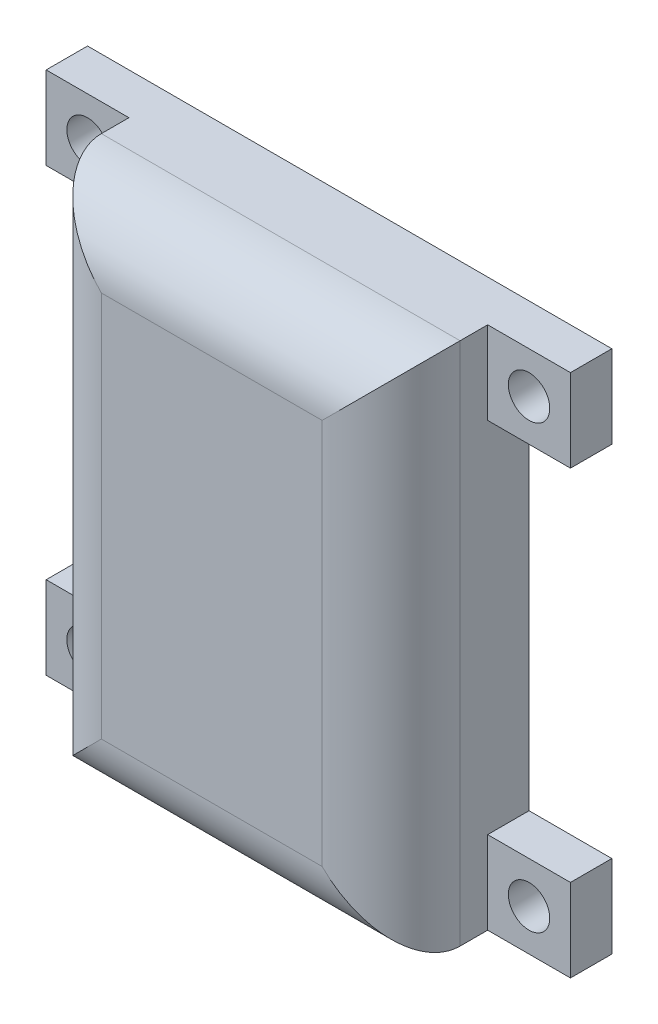
ISO-10303-21;
HEADER;
FILE_DESCRIPTION(('STEP AP214'),'2;1');
FILE_NAME('part.step','',(''),(''),'','','');
FILE_SCHEMA(('AUTOMOTIVE_DESIGN { 1 0 10303 214 1 1 1 1 }'));
ENDSEC;
DATA;
#1=APPLICATION_CONTEXT('core data for automotive mechanical design processes');
#2=APPLICATION_PROTOCOL_DEFINITION('international standard','automotive_design',2000,#1);
#3=PRODUCT_CONTEXT('',#1,'mechanical');
#4=PRODUCT('Part','Part','',(#3));
#5=PRODUCT_RELATED_PRODUCT_CATEGORY('part','',(#4));
#6=PRODUCT_DEFINITION_FORMATION('','',#4);
#7=PRODUCT_DEFINITION_CONTEXT('part definition',#1,'design');
#8=PRODUCT_DEFINITION('design','',#6,#7);
#9=PRODUCT_DEFINITION_SHAPE('','',#8);
#10=(LENGTH_UNIT() NAMED_UNIT(*) SI_UNIT(.MILLI.,.METRE.));
#11=(NAMED_UNIT(*) PLANE_ANGLE_UNIT() SI_UNIT($,.RADIAN.));
#12=(NAMED_UNIT(*) SI_UNIT($,.STERADIAN.) SOLID_ANGLE_UNIT());
#13=UNCERTAINTY_MEASURE_WITH_UNIT(LENGTH_MEASURE(1.E-05),#10,'distance_accuracy_value','');
#14=(GEOMETRIC_REPRESENTATION_CONTEXT(3) GLOBAL_UNCERTAINTY_ASSIGNED_CONTEXT((#13)) GLOBAL_UNIT_ASSIGNED_CONTEXT((#10,
#11,#12)) REPRESENTATION_CONTEXT('',''));
#15=CARTESIAN_POINT('',(0.,0.,0.));
#16=DIRECTION('',(0.,0.,1.));
#17=DIRECTION('',(1.,0.,0.));
#18=AXIS2_PLACEMENT_3D('',#15,#16,#17);
#19=CARTESIAN_POINT('',(-13.,19.,0.));
#20=DIRECTION('',(0.,0.,1.));
#21=DIRECTION('',(1.,0.,0.));
#22=AXIS2_PLACEMENT_3D('',#19,#20,#21);
#23=PLANE('',#22);
#24=CARTESIAN_POINT('',(16.,-16.,0.));
#25=DIRECTION('',(0.,0.,1.));
#26=DIRECTION('',(1.,0.,0.));
#27=AXIS2_PLACEMENT_3D('',#24,#25,#26);
#28=CIRCLE('',#27,1.5);
#29=CARTESIAN_POINT('',(17.5,-16.,0.));
#30=VERTEX_POINT('',#29);
#31=EDGE_CURVE('E494',#30,#30,#28,.T.);
#32=ORIENTED_EDGE('',*,*,#31,.T.);
#33=EDGE_LOOP('',(#32));
#34=FACE_BOUND('',#33,.T.);
#35=CARTESIAN_POINT('',(-16.,16.,0.));
#36=DIRECTION('',(0.,0.,1.));
#37=DIRECTION('',(1.,0.,0.));
#38=AXIS2_PLACEMENT_3D('',#35,#36,#37);
#39=CIRCLE('',#38,1.5);
#40=CARTESIAN_POINT('',(-14.5,16.,0.));
#41=VERTEX_POINT('',#40);
#42=EDGE_CURVE('E500',#41,#41,#39,.T.);
#43=ORIENTED_EDGE('',*,*,#42,.T.);
#44=EDGE_LOOP('',(#43));
#45=FACE_BOUND('',#44,.T.);
#46=DIRECTION('',(0.,-1.,0.));
#47=VECTOR('',#46,1.);
#48=CARTESIAN_POINT('',(-13.,-19.,0.));
#49=LINE('',#48,#47);
#50=CARTESIAN_POINT('',(-13.,13.,0.));
#51=VERTEX_POINT('',#50);
#52=CARTESIAN_POINT('',(-13.,-13.,0.));
#53=VERTEX_POINT('',#52);
#54=EDGE_CURVE('E246',#51,#53,#49,.T.);
#55=ORIENTED_EDGE('',*,*,#54,.F.);
#56=DIRECTION('',(1.,0.,0.));
#57=VECTOR('',#56,1.);
#58=CARTESIAN_POINT('',(-13.,13.,0.));
#59=LINE('',#58,#57);
#60=CARTESIAN_POINT('',(-19.,13.,0.));
#61=VERTEX_POINT('',#60);
#62=EDGE_CURVE('E213',#61,#51,#59,.T.);
#63=ORIENTED_EDGE('',*,*,#62,.F.);
#64=DIRECTION('',(0.,-1.,0.));
#65=VECTOR('',#64,1.);
#66=CARTESIAN_POINT('',(-19.,19.,0.));
#67=LINE('',#66,#65);
#68=CARTESIAN_POINT('',(-19.,19.,0.));
#69=VERTEX_POINT('',#68);
#70=EDGE_CURVE('E211',#69,#61,#67,.T.);
#71=ORIENTED_EDGE('',*,*,#70,.F.);
#72=DIRECTION('',(-1.,0.,0.));
#73=VECTOR('',#72,1.);
#74=CARTESIAN_POINT('',(13.,19.,0.));
#75=LINE('',#74,#73);
#76=CARTESIAN_POINT('',(19.,19.,0.));
#77=VERTEX_POINT('',#76);
#78=EDGE_CURVE('E196',#77,#69,#75,.T.);
#79=ORIENTED_EDGE('',*,*,#78,.F.);
#80=DIRECTION('',(0.,1.,0.));
#81=VECTOR('',#80,1.);
#82=CARTESIAN_POINT('',(19.,19.,0.));
#83=LINE('',#82,#81);
#84=CARTESIAN_POINT('',(19.,13.,0.));
#85=VERTEX_POINT('',#84);
#86=EDGE_CURVE('E304',#85,#77,#83,.T.);
#87=ORIENTED_EDGE('',*,*,#86,.F.);
#88=DIRECTION('',(1.,0.,0.));
#89=VECTOR('',#88,1.);
#90=CARTESIAN_POINT('',(13.,13.,0.));
#91=LINE('',#90,#89);
#92=CARTESIAN_POINT('',(13.,13.,0.));
#93=VERTEX_POINT('',#92);
#94=EDGE_CURVE('E301',#93,#85,#91,.T.);
#95=ORIENTED_EDGE('',*,*,#94,.F.);
#96=DIRECTION('',(0.,1.,0.));
#97=VECTOR('',#96,1.);
#98=CARTESIAN_POINT('',(13.,-19.,0.));
#99=LINE('',#98,#97);
#100=CARTESIAN_POINT('',(13.,-13.,0.));
#101=VERTEX_POINT('',#100);
#102=EDGE_CURVE('E257',#101,#93,#99,.T.);
#103=ORIENTED_EDGE('',*,*,#102,.F.);
#104=DIRECTION('',(-1.,0.,0.));
#105=VECTOR('',#104,1.);
#106=CARTESIAN_POINT('',(13.,-13.,0.));
#107=LINE('',#106,#105);
#108=CARTESIAN_POINT('',(19.,-13.,0.));
#109=VERTEX_POINT('',#108);
#110=EDGE_CURVE('E774',#109,#101,#107,.T.);
#111=ORIENTED_EDGE('',*,*,#110,.F.);
#112=DIRECTION('',(0.,1.,0.));
#113=VECTOR('',#112,1.);
#114=CARTESIAN_POINT('',(19.,-19.,0.));
#115=LINE('',#114,#113);
#116=CARTESIAN_POINT('',(19.,-19.,0.));
#117=VERTEX_POINT('',#116);
#118=EDGE_CURVE('E243',#117,#109,#115,.T.);
#119=ORIENTED_EDGE('',*,*,#118,.F.);
#120=DIRECTION('',(1.,0.,0.));
#121=VECTOR('',#120,1.);
#122=CARTESIAN_POINT('',(13.,-19.,0.));
#123=LINE('',#122,#121);
#124=CARTESIAN_POINT('',(-19.,-19.,0.));
#125=VERTEX_POINT('',#124);
#126=EDGE_CURVE('E249',#125,#117,#123,.T.);
#127=ORIENTED_EDGE('',*,*,#126,.F.);
#128=DIRECTION('',(0.,-1.,0.));
#129=VECTOR('',#128,1.);
#130=CARTESIAN_POINT('',(-19.,-19.,0.));
#131=LINE('',#130,#129);
#132=CARTESIAN_POINT('',(-19.,-13.,0.));
#133=VERTEX_POINT('',#132);
#134=EDGE_CURVE('E225',#133,#125,#131,.T.);
#135=ORIENTED_EDGE('',*,*,#134,.F.);
#136=DIRECTION('',(-1.,0.,0.));
#137=VECTOR('',#136,1.);
#138=CARTESIAN_POINT('',(-13.,-13.,0.));
#139=LINE('',#138,#137);
#140=EDGE_CURVE('E199',#53,#133,#139,.T.);
#141=ORIENTED_EDGE('',*,*,#140,.F.);
#142=EDGE_LOOP('',(#55,#63,#71,#79,#87,#95,#103,#111,#119,#127,#135,#141));
#143=FACE_BOUND('',#142,.T.);
#144=DIRECTION('',(0.,-1.,0.));
#145=VECTOR('',#144,1.);
#146=CARTESIAN_POINT('',(-11.,-17.,0.));
#147=LINE('',#146,#145);
#148=CARTESIAN_POINT('',(-11.,17.,0.));
#149=VERTEX_POINT('',#148);
#150=CARTESIAN_POINT('',(-11.,-17.,0.));
#151=VERTEX_POINT('',#150);
#152=EDGE_CURVE('E335',#149,#151,#147,.T.);
#153=ORIENTED_EDGE('',*,*,#152,.T.);
#154=DIRECTION('',(1.,0.,0.));
#155=VECTOR('',#154,1.);
#156=CARTESIAN_POINT('',(11.,-17.,0.));
#157=LINE('',#156,#155);
#158=CARTESIAN_POINT('',(11.,-17.,0.));
#159=VERTEX_POINT('',#158);
#160=EDGE_CURVE('E338',#151,#159,#157,.T.);
#161=ORIENTED_EDGE('',*,*,#160,.T.);
#162=DIRECTION('',(0.,1.,0.));
#163=VECTOR('',#162,1.);
#164=CARTESIAN_POINT('',(11.,-17.,0.));
#165=LINE('',#164,#163);
#166=CARTESIAN_POINT('',(11.,17.,0.));
#167=VERTEX_POINT('',#166);
#168=EDGE_CURVE('E341',#159,#167,#165,.T.);
#169=ORIENTED_EDGE('',*,*,#168,.T.);
#170=DIRECTION('',(-1.,0.,0.));
#171=VECTOR('',#170,1.);
#172=CARTESIAN_POINT('',(11.,17.,0.));
#173=LINE('',#172,#171);
#174=EDGE_CURVE('E328',#167,#149,#173,.T.);
#175=ORIENTED_EDGE('',*,*,#174,.T.);
#176=EDGE_LOOP('',(#153,#161,#169,#175));
#177=FACE_BOUND('',#176,.T.);
#178=CARTESIAN_POINT('',(-16.,-16.,0.));
#179=DIRECTION('',(0.,0.,1.));
#180=DIRECTION('',(1.,0.,0.));
#181=AXIS2_PLACEMENT_3D('',#178,#179,#180);
#182=CIRCLE('',#181,1.5);
#183=CARTESIAN_POINT('',(-14.5,-16.,0.));
#184=VERTEX_POINT('',#183);
#185=EDGE_CURVE('E497',#184,#184,#182,.T.);
#186=ORIENTED_EDGE('',*,*,#185,.T.);
#187=EDGE_LOOP('',(#186));
#188=FACE_BOUND('',#187,.T.);
#189=CARTESIAN_POINT('',(16.,16.,0.));
#190=DIRECTION('',(0.,0.,1.));
#191=DIRECTION('',(1.,0.,0.));
#192=AXIS2_PLACEMENT_3D('',#189,#190,#191);
#193=CIRCLE('',#192,1.5);
#194=CARTESIAN_POINT('',(17.5,16.,0.));
#195=VERTEX_POINT('',#194);
#196=EDGE_CURVE('E428',#195,#195,#193,.T.);
#197=ORIENTED_EDGE('',*,*,#196,.T.);
#198=EDGE_LOOP('',(#197));
#199=FACE_BOUND('',#198,.T.);
#200=ADVANCED_FACE('F31',(#34,#45,#143,#177,#188,#199),#23,.F.);
#201=CARTESIAN_POINT('',(13.,13.,3.));
#202=DIRECTION('',(0.,0.,1.));
#203=DIRECTION('',(1.,0.,0.));
#204=AXIS2_PLACEMENT_3D('',#201,#202,#203);
#205=PLANE('',#204);
#206=DIRECTION('',(0.,-1.,0.));
#207=VECTOR('',#206,1.);
#208=CARTESIAN_POINT('',(13.,19.,3.));
#209=LINE('',#208,#207);
#210=CARTESIAN_POINT('',(13.,19.,3.));
#211=VERTEX_POINT('',#210);
#212=CARTESIAN_POINT('',(13.,13.,3.));
#213=VERTEX_POINT('',#212);
#214=EDGE_CURVE('E313',#211,#213,#209,.T.);
#215=ORIENTED_EDGE('',*,*,#214,.T.);
#216=DIRECTION('',(1.,0.,0.));
#217=VECTOR('',#216,1.);
#218=CARTESIAN_POINT('',(13.,13.,3.));
#219=LINE('',#218,#217);
#220=CARTESIAN_POINT('',(19.,13.,3.));
#221=VERTEX_POINT('',#220);
#222=EDGE_CURVE('E310',#213,#221,#219,.T.);
#223=ORIENTED_EDGE('',*,*,#222,.T.);
#224=DIRECTION('',(0.,1.,0.));
#225=VECTOR('',#224,1.);
#226=CARTESIAN_POINT('',(19.,19.,3.));
#227=LINE('',#226,#225);
#228=CARTESIAN_POINT('',(19.,19.,3.));
#229=VERTEX_POINT('',#228);
#230=EDGE_CURVE('E312',#221,#229,#227,.T.);
#231=ORIENTED_EDGE('',*,*,#230,.T.);
#232=DIRECTION('',(-1.,0.,0.));
#233=VECTOR('',#232,1.);
#234=CARTESIAN_POINT('',(13.,19.,3.));
#235=LINE('',#234,#233);
#236=EDGE_CURVE('E315',#229,#211,#235,.T.);
#237=ORIENTED_EDGE('',*,*,#236,.T.);
#238=EDGE_LOOP('',(#215,#223,#231,#237));
#239=FACE_BOUND('',#238,.T.);
#240=CARTESIAN_POINT('',(16.,16.,3.));
#241=DIRECTION('',(0.,0.,1.));
#242=DIRECTION('',(1.,0.,0.));
#243=AXIS2_PLACEMENT_3D('',#240,#241,#242);
#244=CIRCLE('',#243,1.5);
#245=CARTESIAN_POINT('',(17.5,16.,3.));
#246=VERTEX_POINT('',#245);
#247=EDGE_CURVE('E431',#246,#246,#244,.F.);
#248=ORIENTED_EDGE('',*,*,#247,.T.);
#249=EDGE_LOOP('',(#248));
#250=FACE_BOUND('',#249,.T.);
#251=ADVANCED_FACE('F380',(#239,#250),#205,.T.);
#252=CARTESIAN_POINT('',(13.,-13.,3.));
#253=DIRECTION('',(0.,0.,-1.));
#254=DIRECTION('',(-1.,0.,0.));
#255=AXIS2_PLACEMENT_3D('',#252,#253,#254);
#256=PLANE('',#255);
#257=DIRECTION('',(0.,-1.,0.));
#258=VECTOR('',#257,1.);
#259=CARTESIAN_POINT('',(13.,-19.,3.));
#260=LINE('',#259,#258);
#261=CARTESIAN_POINT('',(13.,-13.,3.));
#262=VERTEX_POINT('',#261);
#263=CARTESIAN_POINT('',(13.,-19.,3.));
#264=VERTEX_POINT('',#263);
#265=EDGE_CURVE('E237',#262,#264,#260,.T.);
#266=ORIENTED_EDGE('',*,*,#265,.T.);
#267=DIRECTION('',(1.,0.,0.));
#268=VECTOR('',#267,1.);
#269=CARTESIAN_POINT('',(13.,-19.,3.));
#270=LINE('',#269,#268);
#271=CARTESIAN_POINT('',(19.,-19.,3.));
#272=VERTEX_POINT('',#271);
#273=EDGE_CURVE('E769',#264,#272,#270,.T.);
#274=ORIENTED_EDGE('',*,*,#273,.T.);
#275=DIRECTION('',(0.,1.,0.));
#276=VECTOR('',#275,1.);
#277=CARTESIAN_POINT('',(19.,-19.,3.));
#278=LINE('',#277,#276);
#279=CARTESIAN_POINT('',(19.,-13.,3.));
#280=VERTEX_POINT('',#279);
#281=EDGE_CURVE('E300',#272,#280,#278,.T.);
#282=ORIENTED_EDGE('',*,*,#281,.T.);
#283=DIRECTION('',(-1.,0.,0.));
#284=VECTOR('',#283,1.);
#285=CARTESIAN_POINT('',(13.,-13.,3.));
#286=LINE('',#285,#284);
#287=EDGE_CURVE('E772',#280,#262,#286,.T.);
#288=ORIENTED_EDGE('',*,*,#287,.T.);
#289=EDGE_LOOP('',(#266,#274,#282,#288));
#290=FACE_BOUND('',#289,.T.);
#291=CARTESIAN_POINT('',(16.,-16.,3.));
#292=DIRECTION('',(0.,0.,-1.));
#293=DIRECTION('',(-1.,0.,0.));
#294=AXIS2_PLACEMENT_3D('',#291,#292,#293);
#295=CIRCLE('',#294,1.5);
#296=CARTESIAN_POINT('',(14.5,-16.,3.));
#297=VERTEX_POINT('',#296);
#298=EDGE_CURVE('E495',#297,#297,#295,.F.);
#299=ORIENTED_EDGE('',*,*,#298,.F.);
#300=EDGE_LOOP('',(#299));
#301=FACE_BOUND('',#300,.T.);
#302=ADVANCED_FACE('F386',(#290,#301),#256,.F.);
#303=CARTESIAN_POINT('',(-13.,-13.,3.));
#304=DIRECTION('',(0.,0.,1.));
#305=DIRECTION('',(1.,0.,0.));
#306=AXIS2_PLACEMENT_3D('',#303,#304,#305);
#307=PLANE('',#306);
#308=DIRECTION('',(0.,1.,0.));
#309=VECTOR('',#308,1.);
#310=CARTESIAN_POINT('',(-13.,-19.,3.));
#311=LINE('',#310,#309);
#312=CARTESIAN_POINT('',(-13.,-19.,3.));
#313=VERTEX_POINT('',#312);
#314=CARTESIAN_POINT('',(-13.,-13.,3.));
#315=VERTEX_POINT('',#314);
#316=EDGE_CURVE('E222',#313,#315,#311,.T.);
#317=ORIENTED_EDGE('',*,*,#316,.T.);
#318=DIRECTION('',(-1.,0.,0.));
#319=VECTOR('',#318,1.);
#320=CARTESIAN_POINT('',(-13.,-13.,3.));
#321=LINE('',#320,#319);
#322=CARTESIAN_POINT('',(-19.,-13.,3.));
#323=VERTEX_POINT('',#322);
#324=EDGE_CURVE('E219',#315,#323,#321,.T.);
#325=ORIENTED_EDGE('',*,*,#324,.T.);
#326=DIRECTION('',(0.,-1.,0.));
#327=VECTOR('',#326,1.);
#328=CARTESIAN_POINT('',(-19.,-19.,3.));
#329=LINE('',#328,#327);
#330=CARTESIAN_POINT('',(-19.,-19.,3.));
#331=VERTEX_POINT('',#330);
#332=EDGE_CURVE('E221',#323,#331,#329,.T.);
#333=ORIENTED_EDGE('',*,*,#332,.T.);
#334=DIRECTION('',(1.,0.,0.));
#335=VECTOR('',#334,1.);
#336=CARTESIAN_POINT('',(-13.,-19.,3.));
#337=LINE('',#336,#335);
#338=EDGE_CURVE('E224',#331,#313,#337,.T.);
#339=ORIENTED_EDGE('',*,*,#338,.T.);
#340=EDGE_LOOP('',(#317,#325,#333,#339));
#341=FACE_BOUND('',#340,.T.);
#342=CARTESIAN_POINT('',(-16.,-16.,3.));
#343=DIRECTION('',(0.,0.,1.));
#344=DIRECTION('',(1.,0.,0.));
#345=AXIS2_PLACEMENT_3D('',#342,#343,#344);
#346=CIRCLE('',#345,1.5);
#347=CARTESIAN_POINT('',(-14.5,-16.,3.));
#348=VERTEX_POINT('',#347);
#349=EDGE_CURVE('E498',#348,#348,#346,.F.);
#350=ORIENTED_EDGE('',*,*,#349,.T.);
#351=EDGE_LOOP('',(#350));
#352=FACE_BOUND('',#351,.T.);
#353=ADVANCED_FACE('F519',(#341,#352),#307,.T.);
#354=CARTESIAN_POINT('',(-13.,13.,3.));
#355=DIRECTION('',(0.,0.,-1.));
#356=DIRECTION('',(-1.,0.,0.));
#357=AXIS2_PLACEMENT_3D('',#354,#355,#356);
#358=PLANE('',#357);
#359=DIRECTION('',(0.,1.,0.));
#360=VECTOR('',#359,1.);
#361=CARTESIAN_POINT('',(-13.,19.,3.));
#362=LINE('',#361,#360);
#363=CARTESIAN_POINT('',(-13.,13.,3.));
#364=VERTEX_POINT('',#363);
#365=CARTESIAN_POINT('',(-13.,19.,3.));
#366=VERTEX_POINT('',#365);
#367=EDGE_CURVE('E189',#364,#366,#362,.T.);
#368=ORIENTED_EDGE('',*,*,#367,.T.);
#369=DIRECTION('',(-1.,0.,0.));
#370=VECTOR('',#369,1.);
#371=CARTESIAN_POINT('',(-13.,19.,3.));
#372=LINE('',#371,#370);
#373=CARTESIAN_POINT('',(-19.,19.,3.));
#374=VERTEX_POINT('',#373);
#375=EDGE_CURVE('E181',#366,#374,#372,.T.);
#376=ORIENTED_EDGE('',*,*,#375,.T.);
#377=DIRECTION('',(0.,-1.,0.));
#378=VECTOR('',#377,1.);
#379=CARTESIAN_POINT('',(-19.,19.,3.));
#380=LINE('',#379,#378);
#381=CARTESIAN_POINT('',(-19.,13.,3.));
#382=VERTEX_POINT('',#381);
#383=EDGE_CURVE('E187',#374,#382,#380,.T.);
#384=ORIENTED_EDGE('',*,*,#383,.T.);
#385=DIRECTION('',(1.,0.,0.));
#386=VECTOR('',#385,1.);
#387=CARTESIAN_POINT('',(-13.,13.,3.));
#388=LINE('',#387,#386);
#389=EDGE_CURVE('E205',#382,#364,#388,.T.);
#390=ORIENTED_EDGE('',*,*,#389,.T.);
#391=EDGE_LOOP('',(#368,#376,#384,#390));
#392=FACE_BOUND('',#391,.T.);
#393=CARTESIAN_POINT('',(-16.,16.,3.));
#394=DIRECTION('',(0.,0.,-1.));
#395=DIRECTION('',(-1.,0.,0.));
#396=AXIS2_PLACEMENT_3D('',#393,#394,#395);
#397=CIRCLE('',#396,1.5);
#398=CARTESIAN_POINT('',(-17.5,16.,3.));
#399=VERTEX_POINT('',#398);
#400=EDGE_CURVE('E214',#399,#399,#397,.F.);
#401=ORIENTED_EDGE('',*,*,#400,.F.);
#402=EDGE_LOOP('',(#401));
#403=FACE_BOUND('',#402,.T.);
#404=ADVANCED_FACE('F183',(#392,#403),#358,.F.);
#405=CARTESIAN_POINT('',(-13.,-19.,10.));
#406=DIRECTION('',(1.,0.,0.));
#407=DIRECTION('',(0.,0.,-1.));
#408=AXIS2_PLACEMENT_3D('',#405,#406,#407);
#409=PLANE('',#408);
#410=DIRECTION('',(0.,0.,-1.));
#411=VECTOR('',#410,1.);
#412=CARTESIAN_POINT('',(-13.,-19.,10.));
#413=LINE('',#412,#411);
#414=CARTESIAN_POINT('',(-13.,-19.,5.));
#415=VERTEX_POINT('',#414);
#416=EDGE_CURVE('E445',#415,#313,#413,.T.);
#417=ORIENTED_EDGE('',*,*,#416,.F.);
#418=DIRECTION('',(0.,-1.,0.));
#419=VECTOR('',#418,1.);
#420=CARTESIAN_POINT('',(-13.,19.,5.));
#421=LINE('',#420,#419);
#422=CARTESIAN_POINT('',(-13.,19.,5.));
#423=VERTEX_POINT('',#422);
#424=EDGE_CURVE('E48',#415,#423,#421,.F.);
#425=ORIENTED_EDGE('',*,*,#424,.T.);
#426=DIRECTION('',(0.,0.,-1.));
#427=VECTOR('',#426,1.);
#428=CARTESIAN_POINT('',(-13.,19.,10.));
#429=LINE('',#428,#427);
#430=EDGE_CURVE('E470',#423,#366,#429,.T.);
#431=ORIENTED_EDGE('',*,*,#430,.T.);
#432=ORIENTED_EDGE('',*,*,#367,.F.);
#433=DIRECTION('',(0.,0.,-1.));
#434=VECTOR('',#433,1.);
#435=CARTESIAN_POINT('',(-13.,13.,3.));
#436=LINE('',#435,#434);
#437=EDGE_CURVE('E207',#364,#51,#436,.T.);
#438=ORIENTED_EDGE('',*,*,#437,.T.);
#439=ORIENTED_EDGE('',*,*,#54,.T.);
#440=DIRECTION('',(0.,0.,-1.));
#441=VECTOR('',#440,1.);
#442=CARTESIAN_POINT('',(-13.,-13.,3.));
#443=LINE('',#442,#441);
#444=EDGE_CURVE('E234',#315,#53,#443,.T.);
#445=ORIENTED_EDGE('',*,*,#444,.F.);
#446=ORIENTED_EDGE('',*,*,#316,.F.);
#447=EDGE_LOOP('',(#417,#425,#431,#432,#438,#439,#445,#446));
#448=FACE_BOUND('',#447,.T.);
#449=ADVANCED_FACE('F400',(#448),#409,.F.);
#450=CARTESIAN_POINT('',(13.,-19.,10.));
#451=DIRECTION('',(-1.,0.,0.));
#452=DIRECTION('',(0.,0.,1.));
#453=AXIS2_PLACEMENT_3D('',#450,#451,#452);
#454=PLANE('',#453);
#455=DIRECTION('',(0.,0.,-1.));
#456=VECTOR('',#455,1.);
#457=CARTESIAN_POINT('',(13.,19.,10.));
#458=LINE('',#457,#456);
#459=CARTESIAN_POINT('',(13.,19.,5.));
#460=VERTEX_POINT('',#459);
#461=EDGE_CURVE('E468',#460,#211,#458,.T.);
#462=ORIENTED_EDGE('',*,*,#461,.F.);
#463=DIRECTION('',(0.,1.,0.));
#464=VECTOR('',#463,1.);
#465=CARTESIAN_POINT('',(13.,-19.,5.));
#466=LINE('',#465,#464);
#467=CARTESIAN_POINT('',(13.,-19.,5.));
#468=VERTEX_POINT('',#467);
#469=EDGE_CURVE('E444',#460,#468,#466,.F.);
#470=ORIENTED_EDGE('',*,*,#469,.T.);
#471=DIRECTION('',(0.,0.,-1.));
#472=VECTOR('',#471,1.);
#473=CARTESIAN_POINT('',(13.,-19.,10.));
#474=LINE('',#473,#472);
#475=EDGE_CURVE('E448',#468,#264,#474,.T.);
#476=ORIENTED_EDGE('',*,*,#475,.T.);
#477=ORIENTED_EDGE('',*,*,#265,.F.);
#478=DIRECTION('',(0.,0.,-1.));
#479=VECTOR('',#478,1.);
#480=CARTESIAN_POINT('',(13.,-13.,3.));
#481=LINE('',#480,#479);
#482=EDGE_CURVE('E306',#262,#101,#481,.T.);
#483=ORIENTED_EDGE('',*,*,#482,.T.);
#484=ORIENTED_EDGE('',*,*,#102,.T.);
#485=DIRECTION('',(0.,0.,-1.));
#486=VECTOR('',#485,1.);
#487=CARTESIAN_POINT('',(13.,13.,3.));
#488=LINE('',#487,#486);
#489=EDGE_CURVE('E264',#213,#93,#488,.T.);
#490=ORIENTED_EDGE('',*,*,#489,.F.);
#491=ORIENTED_EDGE('',*,*,#214,.F.);
#492=EDGE_LOOP('',(#462,#470,#476,#477,#483,#484,#490,#491));
#493=FACE_BOUND('',#492,.T.);
#494=ADVANCED_FACE('F397',(#493),#454,.F.);
#495=CARTESIAN_POINT('',(13.,-19.,10.));
#496=DIRECTION('',(0.,1.,0.));
#497=DIRECTION('',(-1.,0.,0.));
#498=AXIS2_PLACEMENT_3D('',#495,#496,#497);
#499=PLANE('',#498);
#500=ORIENTED_EDGE('',*,*,#475,.F.);
#501=DIRECTION('',(1.,0.,0.));
#502=VECTOR('',#501,1.);
#503=CARTESIAN_POINT('',(-13.,-19.,5.));
#504=LINE('',#503,#502);
#505=EDGE_CURVE('E11',#468,#415,#504,.F.);
#506=ORIENTED_EDGE('',*,*,#505,.T.);
#507=ORIENTED_EDGE('',*,*,#416,.T.);
#508=ORIENTED_EDGE('',*,*,#338,.F.);
#509=DIRECTION('',(0.,0.,-1.));
#510=VECTOR('',#509,1.);
#511=CARTESIAN_POINT('',(-19.,-19.,3.));
#512=LINE('',#511,#510);
#513=EDGE_CURVE('E228',#331,#125,#512,.T.);
#514=ORIENTED_EDGE('',*,*,#513,.T.);
#515=ORIENTED_EDGE('',*,*,#126,.T.);
#516=DIRECTION('',(0.,0.,-1.));
#517=VECTOR('',#516,1.);
#518=CARTESIAN_POINT('',(19.,-19.,3.));
#519=LINE('',#518,#517);
#520=EDGE_CURVE('E293',#272,#117,#519,.T.);
#521=ORIENTED_EDGE('',*,*,#520,.F.);
#522=ORIENTED_EDGE('',*,*,#273,.F.);
#523=EDGE_LOOP('',(#500,#506,#507,#508,#514,#515,#521,#522));
#524=FACE_BOUND('',#523,.T.);
#525=ADVANCED_FACE('F291',(#524),#499,.F.);
#526=CARTESIAN_POINT('',(13.,19.,10.));
#527=DIRECTION('',(0.,-1.,0.));
#528=DIRECTION('',(0.,0.,-1.));
#529=AXIS2_PLACEMENT_3D('',#526,#527,#528);
#530=PLANE('',#529);
#531=ORIENTED_EDGE('',*,*,#430,.F.);
#532=DIRECTION('',(-1.,0.,0.));
#533=VECTOR('',#532,1.);
#534=CARTESIAN_POINT('',(13.,19.,5.));
#535=LINE('',#534,#533);
#536=EDGE_CURVE('E40',#423,#460,#535,.F.);
#537=ORIENTED_EDGE('',*,*,#536,.T.);
#538=ORIENTED_EDGE('',*,*,#461,.T.);
#539=ORIENTED_EDGE('',*,*,#236,.F.);
#540=DIRECTION('',(0.,0.,-1.));
#541=VECTOR('',#540,1.);
#542=CARTESIAN_POINT('',(19.,19.,3.));
#543=LINE('',#542,#541);
#544=EDGE_CURVE('E318',#229,#77,#543,.T.);
#545=ORIENTED_EDGE('',*,*,#544,.T.);
#546=ORIENTED_EDGE('',*,*,#78,.T.);
#547=DIRECTION('',(0.,0.,-1.));
#548=VECTOR('',#547,1.);
#549=CARTESIAN_POINT('',(-19.,19.,3.));
#550=LINE('',#549,#548);
#551=EDGE_CURVE('E193',#374,#69,#550,.T.);
#552=ORIENTED_EDGE('',*,*,#551,.F.);
#553=ORIENTED_EDGE('',*,*,#375,.F.);
#554=EDGE_LOOP('',(#531,#537,#538,#539,#545,#546,#552,#553));
#555=FACE_BOUND('',#554,.T.);
#556=ADVANCED_FACE('F194',(#555),#530,.F.);
#557=CARTESIAN_POINT('',(-13.,19.,10.));
#558=DIRECTION('',(0.,0.,1.));
#559=DIRECTION('',(1.,0.,0.));
#560=AXIS2_PLACEMENT_3D('',#557,#558,#559);
#561=PLANE('',#560);
#562=DIRECTION('',(0.,1.,0.));
#563=VECTOR('',#562,1.);
#564=CARTESIAN_POINT('',(8.,19.,10.));
#565=LINE('',#564,#563);
#566=CARTESIAN_POINT('',(8.,-14.,10.));
#567=VERTEX_POINT('',#566);
#568=CARTESIAN_POINT('',(8.,14.,10.));
#569=VERTEX_POINT('',#568);
#570=EDGE_CURVE('E486',#567,#569,#565,.T.);
#571=ORIENTED_EDGE('',*,*,#570,.T.);
#572=DIRECTION('',(-1.,0.,0.));
#573=VECTOR('',#572,1.);
#574=CARTESIAN_POINT('',(-13.,14.,10.));
#575=LINE('',#574,#573);
#576=CARTESIAN_POINT('',(-8.,14.,10.));
#577=VERTEX_POINT('',#576);
#578=EDGE_CURVE('E484',#569,#577,#575,.T.);
#579=ORIENTED_EDGE('',*,*,#578,.T.);
#580=DIRECTION('',(0.,-1.,0.));
#581=VECTOR('',#580,1.);
#582=CARTESIAN_POINT('',(-8.,-19.,10.));
#583=LINE('',#582,#581);
#584=CARTESIAN_POINT('',(-8.,-14.,10.));
#585=VERTEX_POINT('',#584);
#586=EDGE_CURVE('E489',#577,#585,#583,.T.);
#587=ORIENTED_EDGE('',*,*,#586,.T.);
#588=DIRECTION('',(1.,0.,0.));
#589=VECTOR('',#588,1.);
#590=CARTESIAN_POINT('',(13.,-14.,10.));
#591=LINE('',#590,#589);
#592=EDGE_CURVE('E426',#585,#567,#591,.T.);
#593=ORIENTED_EDGE('',*,*,#592,.T.);
#594=EDGE_LOOP('',(#571,#579,#587,#593));
#595=FACE_BOUND('',#594,.T.);
#596=ADVANCED_FACE('F393',(#595),#561,.T.);
#597=CARTESIAN_POINT('',(-11.,-17.,8.));
#598=DIRECTION('',(1.,0.,0.));
#599=DIRECTION('',(0.,0.,-1.));
#600=AXIS2_PLACEMENT_3D('',#597,#598,#599);
#601=PLANE('',#600);
#602=ORIENTED_EDGE('',*,*,#152,.F.);
#603=DIRECTION('',(0.,0.,-1.));
#604=VECTOR('',#603,1.);
#605=CARTESIAN_POINT('',(-11.,17.,8.));
#606=LINE('',#605,#604);
#607=CARTESIAN_POINT('',(-11.,17.,8.));
#608=VERTEX_POINT('',#607);
#609=EDGE_CURVE('E334',#608,#149,#606,.T.);
#610=ORIENTED_EDGE('',*,*,#609,.F.);
#611=DIRECTION('',(0.,-1.,0.));
#612=VECTOR('',#611,1.);
#613=CARTESIAN_POINT('',(-11.,-17.,8.));
#614=LINE('',#613,#612);
#615=CARTESIAN_POINT('',(-11.,-17.,8.));
#616=VERTEX_POINT('',#615);
#617=EDGE_CURVE('E324',#608,#616,#614,.T.);
#618=ORIENTED_EDGE('',*,*,#617,.T.);
#619=DIRECTION('',(0.,0.,-1.));
#620=VECTOR('',#619,1.);
#621=CARTESIAN_POINT('',(-11.,-17.,8.));
#622=LINE('',#621,#620);
#623=EDGE_CURVE('E250',#616,#151,#622,.T.);
#624=ORIENTED_EDGE('',*,*,#623,.T.);
#625=EDGE_LOOP('',(#602,#610,#618,#624));
#626=FACE_BOUND('',#625,.T.);
#627=ADVANCED_FACE('F356',(#626),#601,.T.);
#628=CARTESIAN_POINT('',(11.,-17.,8.));
#629=DIRECTION('',(0.,1.,0.));
#630=DIRECTION('',(-1.,0.,0.));
#631=AXIS2_PLACEMENT_3D('',#628,#629,#630);
#632=PLANE('',#631);
#633=ORIENTED_EDGE('',*,*,#160,.F.);
#634=ORIENTED_EDGE('',*,*,#623,.F.);
#635=DIRECTION('',(1.,0.,0.));
#636=VECTOR('',#635,1.);
#637=CARTESIAN_POINT('',(11.,-17.,8.));
#638=LINE('',#637,#636);
#639=CARTESIAN_POINT('',(11.,-17.,8.));
#640=VERTEX_POINT('',#639);
#641=EDGE_CURVE('E327',#616,#640,#638,.T.);
#642=ORIENTED_EDGE('',*,*,#641,.T.);
#643=DIRECTION('',(0.,0.,-1.));
#644=VECTOR('',#643,1.);
#645=CARTESIAN_POINT('',(11.,-17.,8.));
#646=LINE('',#645,#644);
#647=EDGE_CURVE('E349',#640,#159,#646,.T.);
#648=ORIENTED_EDGE('',*,*,#647,.T.);
#649=EDGE_LOOP('',(#633,#634,#642,#648));
#650=FACE_BOUND('',#649,.T.);
#651=ADVANCED_FACE('F368',(#650),#632,.T.);
#652=CARTESIAN_POINT('',(11.,-17.,8.));
#653=DIRECTION('',(-1.,0.,0.));
#654=DIRECTION('',(0.,0.,1.));
#655=AXIS2_PLACEMENT_3D('',#652,#653,#654);
#656=PLANE('',#655);
#657=ORIENTED_EDGE('',*,*,#168,.F.);
#658=ORIENTED_EDGE('',*,*,#647,.F.);
#659=DIRECTION('',(0.,1.,0.));
#660=VECTOR('',#659,1.);
#661=CARTESIAN_POINT('',(11.,-17.,8.));
#662=LINE('',#661,#660);
#663=CARTESIAN_POINT('',(11.,17.,8.));
#664=VERTEX_POINT('',#663);
#665=EDGE_CURVE('E330',#640,#664,#662,.T.);
#666=ORIENTED_EDGE('',*,*,#665,.T.);
#667=DIRECTION('',(0.,0.,-1.));
#668=VECTOR('',#667,1.);
#669=CARTESIAN_POINT('',(11.,17.,8.));
#670=LINE('',#669,#668);
#671=EDGE_CURVE('E348',#664,#167,#670,.T.);
#672=ORIENTED_EDGE('',*,*,#671,.T.);
#673=EDGE_LOOP('',(#657,#658,#666,#672));
#674=FACE_BOUND('',#673,.T.);
#675=ADVANCED_FACE('F370',(#674),#656,.T.);
#676=CARTESIAN_POINT('',(11.,17.,8.));
#677=DIRECTION('',(0.,-1.,0.));
#678=DIRECTION('',(0.,0.,-1.));
#679=AXIS2_PLACEMENT_3D('',#676,#677,#678);
#680=PLANE('',#679);
#681=ORIENTED_EDGE('',*,*,#174,.F.);
#682=ORIENTED_EDGE('',*,*,#671,.F.);
#683=DIRECTION('',(-1.,0.,0.));
#684=VECTOR('',#683,1.);
#685=CARTESIAN_POINT('',(11.,17.,8.));
#686=LINE('',#685,#684);
#687=EDGE_CURVE('E332',#664,#608,#686,.T.);
#688=ORIENTED_EDGE('',*,*,#687,.T.);
#689=ORIENTED_EDGE('',*,*,#609,.T.);
#690=EDGE_LOOP('',(#681,#682,#688,#689));
#691=FACE_BOUND('',#690,.T.);
#692=ADVANCED_FACE('F363',(#691),#680,.T.);
#693=CARTESIAN_POINT('',(-11.,17.,8.));
#694=DIRECTION('',(0.,0.,1.));
#695=DIRECTION('',(1.,0.,0.));
#696=AXIS2_PLACEMENT_3D('',#693,#694,#695);
#697=PLANE('',#696);
#698=ORIENTED_EDGE('',*,*,#617,.F.);
#699=ORIENTED_EDGE('',*,*,#687,.F.);
#700=ORIENTED_EDGE('',*,*,#665,.F.);
#701=ORIENTED_EDGE('',*,*,#641,.F.);
#702=EDGE_LOOP('',(#698,#699,#700,#701));
#703=FACE_BOUND('',#702,.T.);
#704=ADVANCED_FACE('F366',(#703),#697,.F.);
#705=CARTESIAN_POINT('',(13.,13.,3.));
#706=DIRECTION('',(0.,1.,0.));
#707=DIRECTION('',(-1.,0.,0.));
#708=AXIS2_PLACEMENT_3D('',#705,#706,#707);
#709=PLANE('',#708);
#710=ORIENTED_EDGE('',*,*,#94,.T.);
#711=DIRECTION('',(0.,0.,-1.));
#712=VECTOR('',#711,1.);
#713=CARTESIAN_POINT('',(19.,13.,3.));
#714=LINE('',#713,#712);
#715=EDGE_CURVE('E320',#221,#85,#714,.T.);
#716=ORIENTED_EDGE('',*,*,#715,.F.);
#717=ORIENTED_EDGE('',*,*,#222,.F.);
#718=ORIENTED_EDGE('',*,*,#489,.T.);
#719=EDGE_LOOP('',(#710,#716,#717,#718));
#720=FACE_BOUND('',#719,.T.);
#721=ADVANCED_FACE('F477',(#720),#709,.F.);
#722=CARTESIAN_POINT('',(19.,19.,3.));
#723=DIRECTION('',(-1.,0.,0.));
#724=DIRECTION('',(0.,-1.,0.));
#725=AXIS2_PLACEMENT_3D('',#722,#723,#724);
#726=PLANE('',#725);
#727=ORIENTED_EDGE('',*,*,#86,.T.);
#728=ORIENTED_EDGE('',*,*,#544,.F.);
#729=ORIENTED_EDGE('',*,*,#230,.F.);
#730=ORIENTED_EDGE('',*,*,#715,.T.);
#731=EDGE_LOOP('',(#727,#728,#729,#730));
#732=FACE_BOUND('',#731,.T.);
#733=ADVANCED_FACE('F480',(#732),#726,.F.);
#734=CARTESIAN_POINT('',(19.,-19.,3.));
#735=DIRECTION('',(-1.,0.,0.));
#736=DIRECTION('',(0.,0.,1.));
#737=AXIS2_PLACEMENT_3D('',#734,#735,#736);
#738=PLANE('',#737);
#739=ORIENTED_EDGE('',*,*,#118,.T.);
#740=DIRECTION('',(0.,0.,-1.));
#741=VECTOR('',#740,1.);
#742=CARTESIAN_POINT('',(19.,-13.,3.));
#743=LINE('',#742,#741);
#744=EDGE_CURVE('E302',#280,#109,#743,.T.);
#745=ORIENTED_EDGE('',*,*,#744,.F.);
#746=ORIENTED_EDGE('',*,*,#281,.F.);
#747=ORIENTED_EDGE('',*,*,#520,.T.);
#748=EDGE_LOOP('',(#739,#745,#746,#747));
#749=FACE_BOUND('',#748,.T.);
#750=ADVANCED_FACE('F297',(#749),#738,.F.);
#751=CARTESIAN_POINT('',(13.,-13.,3.));
#752=DIRECTION('',(0.,-1.,0.));
#753=DIRECTION('',(0.,0.,-1.));
#754=AXIS2_PLACEMENT_3D('',#751,#752,#753);
#755=PLANE('',#754);
#756=ORIENTED_EDGE('',*,*,#110,.T.);
#757=ORIENTED_EDGE('',*,*,#482,.F.);
#758=ORIENTED_EDGE('',*,*,#287,.F.);
#759=ORIENTED_EDGE('',*,*,#744,.T.);
#760=EDGE_LOOP('',(#756,#757,#758,#759));
#761=FACE_BOUND('',#760,.T.);
#762=ADVANCED_FACE('F531',(#761),#755,.F.);
#763=CARTESIAN_POINT('',(-13.,-13.,3.));
#764=DIRECTION('',(0.,-1.,0.));
#765=DIRECTION('',(0.,0.,-1.));
#766=AXIS2_PLACEMENT_3D('',#763,#764,#765);
#767=PLANE('',#766);
#768=ORIENTED_EDGE('',*,*,#140,.T.);
#769=DIRECTION('',(0.,0.,-1.));
#770=VECTOR('',#769,1.);
#771=CARTESIAN_POINT('',(-19.,-13.,3.));
#772=LINE('',#771,#770);
#773=EDGE_CURVE('E231',#323,#133,#772,.T.);
#774=ORIENTED_EDGE('',*,*,#773,.F.);
#775=ORIENTED_EDGE('',*,*,#324,.F.);
#776=ORIENTED_EDGE('',*,*,#444,.T.);
#777=EDGE_LOOP('',(#768,#774,#775,#776));
#778=FACE_BOUND('',#777,.T.);
#779=ADVANCED_FACE('F277',(#778),#767,.F.);
#780=CARTESIAN_POINT('',(-19.,-19.,3.));
#781=DIRECTION('',(1.,0.,0.));
#782=DIRECTION('',(0.,0.,-1.));
#783=AXIS2_PLACEMENT_3D('',#780,#781,#782);
#784=PLANE('',#783);
#785=ORIENTED_EDGE('',*,*,#134,.T.);
#786=ORIENTED_EDGE('',*,*,#513,.F.);
#787=ORIENTED_EDGE('',*,*,#332,.F.);
#788=ORIENTED_EDGE('',*,*,#773,.T.);
#789=EDGE_LOOP('',(#785,#786,#787,#788));
#790=FACE_BOUND('',#789,.T.);
#791=ADVANCED_FACE('F284',(#790),#784,.F.);
#792=CARTESIAN_POINT('',(-19.,19.,3.));
#793=DIRECTION('',(1.,0.,0.));
#794=DIRECTION('',(0.,0.,-1.));
#795=AXIS2_PLACEMENT_3D('',#792,#793,#794);
#796=PLANE('',#795);
#797=ORIENTED_EDGE('',*,*,#70,.T.);
#798=DIRECTION('',(0.,0.,-1.));
#799=VECTOR('',#798,1.);
#800=CARTESIAN_POINT('',(-19.,13.,3.));
#801=LINE('',#800,#799);
#802=EDGE_CURVE('E200',#382,#61,#801,.T.);
#803=ORIENTED_EDGE('',*,*,#802,.F.);
#804=ORIENTED_EDGE('',*,*,#383,.F.);
#805=ORIENTED_EDGE('',*,*,#551,.T.);
#806=EDGE_LOOP('',(#797,#803,#804,#805));
#807=FACE_BOUND('',#806,.T.);
#808=ADVANCED_FACE('F202',(#807),#796,.F.);
#809=CARTESIAN_POINT('',(-13.,13.,3.));
#810=DIRECTION('',(0.,1.,0.));
#811=DIRECTION('',(0.,0.,1.));
#812=AXIS2_PLACEMENT_3D('',#809,#810,#811);
#813=PLANE('',#812);
#814=ORIENTED_EDGE('',*,*,#62,.T.);
#815=ORIENTED_EDGE('',*,*,#437,.F.);
#816=ORIENTED_EDGE('',*,*,#389,.F.);
#817=ORIENTED_EDGE('',*,*,#802,.T.);
#818=EDGE_LOOP('',(#814,#815,#816,#817));
#819=FACE_BOUND('',#818,.T.);
#820=ADVANCED_FACE('F578',(#819),#813,.F.);
#821=CARTESIAN_POINT('',(-16.,16.,10.000025));
#822=DIRECTION('',(0.,0.,-1.));
#823=DIRECTION('',(-1.,0.,0.));
#824=AXIS2_PLACEMENT_3D('',#821,#822,#823);
#825=CYLINDRICAL_SURFACE('',#824,1.5);
#826=ORIENTED_EDGE('',*,*,#42,.F.);
#827=EDGE_LOOP('',(#826));
#828=FACE_BOUND('',#827,.T.);
#829=ORIENTED_EDGE('',*,*,#400,.T.);
#830=EDGE_LOOP('',(#829));
#831=FACE_BOUND('',#830,.T.);
#832=ADVANCED_FACE('F585',(#828,#831),#825,.F.);
#833=CARTESIAN_POINT('',(-16.,-16.,10.000025));
#834=DIRECTION('',(0.,0.,-1.));
#835=DIRECTION('',(-1.,0.,0.));
#836=AXIS2_PLACEMENT_3D('',#833,#834,#835);
#837=CYLINDRICAL_SURFACE('',#836,1.5);
#838=ORIENTED_EDGE('',*,*,#349,.F.);
#839=EDGE_LOOP('',(#838));
#840=FACE_BOUND('',#839,.T.);
#841=ORIENTED_EDGE('',*,*,#185,.F.);
#842=EDGE_LOOP('',(#841));
#843=FACE_BOUND('',#842,.T.);
#844=ADVANCED_FACE('F514',(#840,#843),#837,.F.);
#845=CARTESIAN_POINT('',(16.,-16.,10.000025));
#846=DIRECTION('',(0.,0.,-1.));
#847=DIRECTION('',(-1.,0.,0.));
#848=AXIS2_PLACEMENT_3D('',#845,#846,#847);
#849=CYLINDRICAL_SURFACE('',#848,1.5);
#850=ORIENTED_EDGE('',*,*,#31,.F.);
#851=EDGE_LOOP('',(#850));
#852=FACE_BOUND('',#851,.T.);
#853=ORIENTED_EDGE('',*,*,#298,.T.);
#854=EDGE_LOOP('',(#853));
#855=FACE_BOUND('',#854,.T.);
#856=ADVANCED_FACE('F511',(#852,#855),#849,.F.);
#857=CARTESIAN_POINT('',(16.,16.,10.000025));
#858=DIRECTION('',(0.,0.,-1.));
#859=DIRECTION('',(-1.,0.,0.));
#860=AXIS2_PLACEMENT_3D('',#857,#858,#859);
#861=CYLINDRICAL_SURFACE('',#860,1.5);
#862=ORIENTED_EDGE('',*,*,#247,.F.);
#863=EDGE_LOOP('',(#862));
#864=FACE_BOUND('',#863,.T.);
#865=ORIENTED_EDGE('',*,*,#196,.F.);
#866=EDGE_LOOP('',(#865));
#867=FACE_BOUND('',#866,.T.);
#868=ADVANCED_FACE('F419',(#864,#867),#861,.F.);
#869=CARTESIAN_POINT('',(-8.,19.,5.));
#870=DIRECTION('',(0.,1.,0.));
#871=DIRECTION('',(0.,0.,1.));
#872=AXIS2_PLACEMENT_3D('',#869,#870,#871);
#873=CYLINDRICAL_SURFACE('',#872,5.);
#874=CARTESIAN_POINT('',(-8.,14.,5.));
#875=DIRECTION('',(0.707106781186547,0.707106781186547,0.));
#876=DIRECTION('',(0.707106781186547,-0.707106781186547,0.));
#877=AXIS2_PLACEMENT_3D('',#874,#875,#876);
#878=ELLIPSE('',#877,7.07106781186547,5.);
#879=EDGE_CURVE('E429',#423,#577,#878,.T.);
#880=ORIENTED_EDGE('',*,*,#879,.F.);
#881=ORIENTED_EDGE('',*,*,#424,.F.);
#882=CARTESIAN_POINT('',(-8.,-14.,5.));
#883=DIRECTION('',(-0.707106781186548,0.707106781186547,0.));
#884=DIRECTION('',(-0.707106781186547,-0.707106781186548,0.));
#885=AXIS2_PLACEMENT_3D('',#882,#883,#884);
#886=ELLIPSE('',#885,7.07106781186548,5.);
#887=EDGE_CURVE('E35',#585,#415,#886,.F.);
#888=ORIENTED_EDGE('',*,*,#887,.F.);
#889=ORIENTED_EDGE('',*,*,#586,.F.);
#890=EDGE_LOOP('',(#880,#881,#888,#889));
#891=FACE_BOUND('',#890,.T.);
#892=ADVANCED_FACE('F33',(#891),#873,.T.);
#893=CARTESIAN_POINT('',(-13.,-14.,5.));
#894=DIRECTION('',(-1.,0.,0.));
#895=DIRECTION('',(0.,-1.,0.));
#896=AXIS2_PLACEMENT_3D('',#893,#894,#895);
#897=CYLINDRICAL_SURFACE('',#896,5.);
#898=ORIENTED_EDGE('',*,*,#887,.T.);
#899=ORIENTED_EDGE('',*,*,#505,.F.);
#900=CARTESIAN_POINT('',(8.,-14.,5.));
#901=DIRECTION('',(-0.707106781186547,-0.707106781186548,0.));
#902=DIRECTION('',(-0.707106781186548,0.707106781186547,0.));
#903=AXIS2_PLACEMENT_3D('',#900,#901,#902);
#904=ELLIPSE('',#903,7.07106781186547,5.);
#905=EDGE_CURVE('E434',#567,#468,#904,.F.);
#906=ORIENTED_EDGE('',*,*,#905,.F.);
#907=ORIENTED_EDGE('',*,*,#592,.F.);
#908=EDGE_LOOP('',(#898,#899,#906,#907));
#909=FACE_BOUND('',#908,.T.);
#910=ADVANCED_FACE('F412',(#909),#897,.T.);
#911=CARTESIAN_POINT('',(-13.,14.,5.));
#912=DIRECTION('',(1.,0.,0.));
#913=DIRECTION('',(0.,0.,-1.));
#914=AXIS2_PLACEMENT_3D('',#911,#912,#913);
#915=CYLINDRICAL_SURFACE('',#914,5.);
#916=ORIENTED_EDGE('',*,*,#879,.T.);
#917=ORIENTED_EDGE('',*,*,#578,.F.);
#918=CARTESIAN_POINT('',(8.,14.,5.));
#919=DIRECTION('',(0.707106781186547,-0.707106781186547,0.));
#920=DIRECTION('',(0.707106781186547,0.707106781186547,0.));
#921=AXIS2_PLACEMENT_3D('',#918,#919,#920);
#922=ELLIPSE('',#921,7.07106781186547,5.);
#923=EDGE_CURVE('E438',#460,#569,#922,.T.);
#924=ORIENTED_EDGE('',*,*,#923,.F.);
#925=ORIENTED_EDGE('',*,*,#536,.F.);
#926=EDGE_LOOP('',(#916,#917,#924,#925));
#927=FACE_BOUND('',#926,.T.);
#928=ADVANCED_FACE('F409',(#927),#915,.T.);
#929=CARTESIAN_POINT('',(8.,19.,5.));
#930=DIRECTION('',(0.,-1.,0.));
#931=DIRECTION('',(0.,0.,-1.));
#932=AXIS2_PLACEMENT_3D('',#929,#930,#931);
#933=CYLINDRICAL_SURFACE('',#932,5.);
#934=ORIENTED_EDGE('',*,*,#905,.T.);
#935=ORIENTED_EDGE('',*,*,#469,.F.);
#936=ORIENTED_EDGE('',*,*,#923,.T.);
#937=ORIENTED_EDGE('',*,*,#570,.F.);
#938=EDGE_LOOP('',(#934,#935,#936,#937));
#939=FACE_BOUND('',#938,.T.);
#940=ADVANCED_FACE('F406',(#939),#933,.T.);
#941=CLOSED_SHELL('',(#200,#251,#302,#353,#404,#449,#494,#525,#556,#596,#627,#651,#675,#692,
#704,#721,#733,#750,#762,#779,#791,#808,#820,#832,#844,#856,#868,#892,#910,#928,#940));
#942=MANIFOLD_SOLID_BREP('B2',#941);
#943=ADVANCED_BREP_SHAPE_REPRESENTATION('',(#18,#942),#14);
#944=SHAPE_DEFINITION_REPRESENTATION(#9,#943);
ENDSEC;
END-ISO-10303-21;
